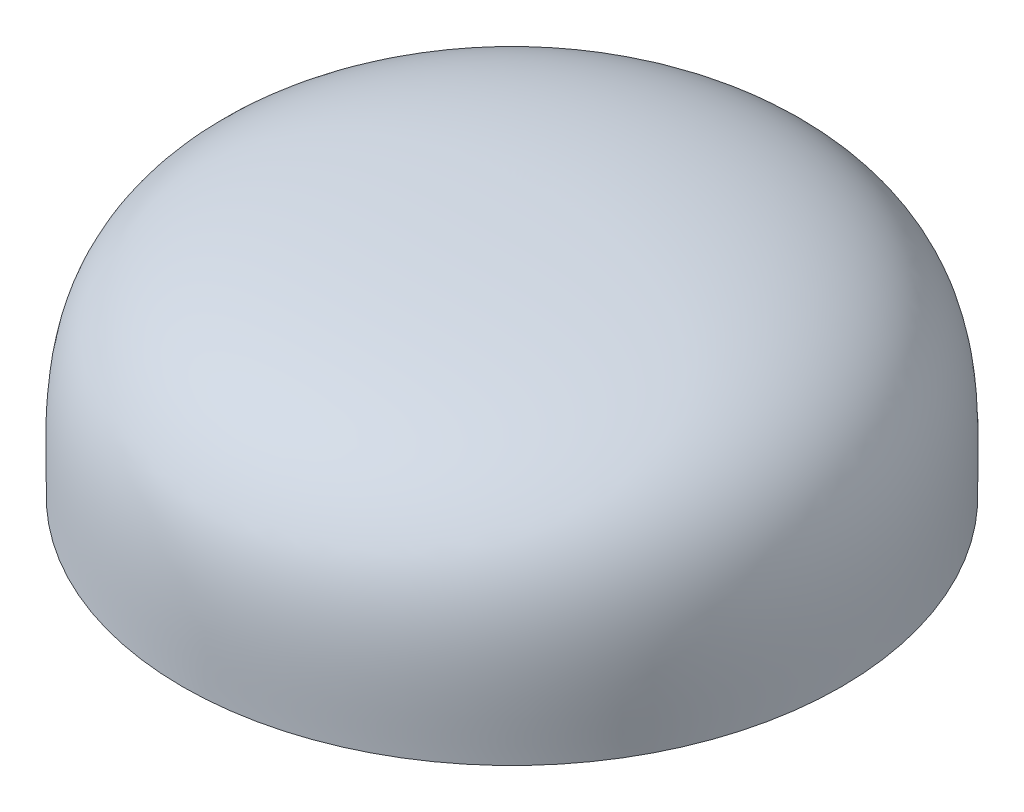
ISO-10303-21;
HEADER;
FILE_DESCRIPTION(('STEP AP214'),'2;1');
FILE_NAME('part.step','',(''),(''),'','','');
FILE_SCHEMA(('AUTOMOTIVE_DESIGN { 1 0 10303 214 1 1 1 1 }'));
ENDSEC;
DATA;
#1=APPLICATION_CONTEXT('core data for automotive mechanical design processes');
#2=APPLICATION_PROTOCOL_DEFINITION('international standard','automotive_design',2000,#1);
#3=PRODUCT_CONTEXT('',#1,'mechanical');
#4=PRODUCT('Part','Part','',(#3));
#5=PRODUCT_RELATED_PRODUCT_CATEGORY('part','',(#4));
#6=PRODUCT_DEFINITION_FORMATION('','',#4);
#7=PRODUCT_DEFINITION_CONTEXT('part definition',#1,'design');
#8=PRODUCT_DEFINITION('design','',#6,#7);
#9=PRODUCT_DEFINITION_SHAPE('','',#8);
#10=(LENGTH_UNIT() NAMED_UNIT(*) SI_UNIT(.MILLI.,.METRE.));
#11=(NAMED_UNIT(*) PLANE_ANGLE_UNIT() SI_UNIT($,.RADIAN.));
#12=(NAMED_UNIT(*) SI_UNIT($,.STERADIAN.) SOLID_ANGLE_UNIT());
#13=UNCERTAINTY_MEASURE_WITH_UNIT(LENGTH_MEASURE(1.E-05),#10,'distance_accuracy_value','');
#14=(GEOMETRIC_REPRESENTATION_CONTEXT(3) GLOBAL_UNCERTAINTY_ASSIGNED_CONTEXT((#13)) GLOBAL_UNIT_ASSIGNED_CONTEXT((#10,
#11,#12)) REPRESENTATION_CONTEXT('',''));
#15=CARTESIAN_POINT('',(0.,0.,0.));
#16=DIRECTION('',(0.,0.,1.));
#17=DIRECTION('',(1.,0.,0.));
#18=AXIS2_PLACEMENT_3D('',#15,#16,#17);
#19=CARTESIAN_POINT('',(0.,3.,0.));
#20=DIRECTION('',(0.,-1.,0.));
#21=DIRECTION('',(0.,0.,-1.));
#22=AXIS2_PLACEMENT_3D('',#19,#20,#21);
#23=CYLINDRICAL_SURFACE('',#22,1.5);
#24=CARTESIAN_POINT('',(0.,3.,0.));
#25=DIRECTION('',(0.,-1.,0.));
#26=DIRECTION('',(0.,0.,-1.));
#27=AXIS2_PLACEMENT_3D('',#24,#25,#26);
#28=CIRCLE('',#27,1.5);
#29=CARTESIAN_POINT('',(0.,3.,-1.5));
#30=VERTEX_POINT('',#29);
#31=EDGE_CURVE('E64',#30,#30,#28,.T.);
#32=ORIENTED_EDGE('',*,*,#31,.F.);
#33=EDGE_LOOP('',(#32));
#34=FACE_BOUND('',#33,.T.);
#35=CARTESIAN_POINT('',(0.,0.,0.));
#36=DIRECTION('',(0.,-1.,0.));
#37=DIRECTION('',(0.,0.,-1.));
#38=AXIS2_PLACEMENT_3D('',#35,#36,#37);
#39=CIRCLE('',#38,1.5);
#40=CARTESIAN_POINT('',(0.,0.,-1.5));
#41=VERTEX_POINT('',#40);
#42=EDGE_CURVE('E11',#41,#41,#39,.T.);
#43=ORIENTED_EDGE('',*,*,#42,.T.);
#44=EDGE_LOOP('',(#43));
#45=FACE_BOUND('',#44,.T.);
#46=ADVANCED_FACE('F33',(#34,#45),#23,.F.);
#47=CARTESIAN_POINT('',(-1.5,0.,0.));
#48=DIRECTION('',(0.,1.,0.));
#49=DIRECTION('',(0.,0.,1.));
#50=AXIS2_PLACEMENT_3D('',#47,#48,#49);
#51=PLANE('',#50);
#52=ORIENTED_EDGE('',*,*,#42,.F.);
#53=EDGE_LOOP('',(#52));
#54=FACE_BOUND('',#53,.T.);
#55=CARTESIAN_POINT('',(0.,0.,0.));
#56=DIRECTION('',(0.,-1.,0.));
#57=DIRECTION('',(0.,0.,-1.));
#58=AXIS2_PLACEMENT_3D('',#55,#56,#57);
#59=CIRCLE('',#58,6.5);
#60=CARTESIAN_POINT('',(0.,0.,-6.5));
#61=VERTEX_POINT('',#60);
#62=EDGE_CURVE('E39',#61,#61,#59,.T.);
#63=ORIENTED_EDGE('',*,*,#62,.T.);
#64=EDGE_LOOP('',(#63));
#65=FACE_BOUND('',#64,.T.);
#66=ADVANCED_FACE('F45',(#54,#65),#51,.F.);
#67=CARTESIAN_POINT('',(0.,5.,0.));
#68=CARTESIAN_POINT('',(-6.96378582869241,5.,0.));
#69=CARTESIAN_POINT('',(-6.5,2.45944889942623,0.));
#70=CARTESIAN_POINT('',(-6.5,0.,0.));
#71=B_SPLINE_CURVE_WITH_KNOTS('',3,(#67,#68,#69,#70),.UNSPECIFIED.,.F.,.F.,(4,4),(0.,1.),.UNSPECIFIED.);
#72=CARTESIAN_POINT('',(0.,3.,0.));
#73=DIRECTION('',(0.,-1.,0.));
#74=AXIS1_PLACEMENT('',#72,#73);
#75=SURFACE_OF_REVOLUTION('',#71,#74);
#76=ORIENTED_EDGE('',*,*,#62,.F.);
#77=EDGE_LOOP('',(#76));
#78=FACE_BOUND('',#77,.T.);
#79=CARTESIAN_POINT('',(0.,5.,0.));
#80=VERTEX_POINT('',#79);
#81=VERTEX_LOOP('',#80);
#82=FACE_BOUND('',#81,.T.);
#83=ADVANCED_FACE('F42',(#78,#82),#75,.T.);
#84=CARTESIAN_POINT('',(0.,3.,0.));
#85=DIRECTION('',(0.,1.,0.));
#86=DIRECTION('',(0.,0.,1.));
#87=AXIS2_PLACEMENT_3D('',#84,#85,#86);
#88=PLANE('',#87);
#89=ORIENTED_EDGE('',*,*,#31,.T.);
#90=EDGE_LOOP('',(#89));
#91=FACE_BOUND('',#90,.T.);
#92=ADVANCED_FACE('F44',(#91),#88,.F.);
#93=CLOSED_SHELL('',(#46,#66,#83,#92));
#94=MANIFOLD_SOLID_BREP('B2',#93);
#95=ADVANCED_BREP_SHAPE_REPRESENTATION('',(#18,#94),#14);
#96=SHAPE_DEFINITION_REPRESENTATION(#9,#95);
ENDSEC;
END-ISO-10303-21;
